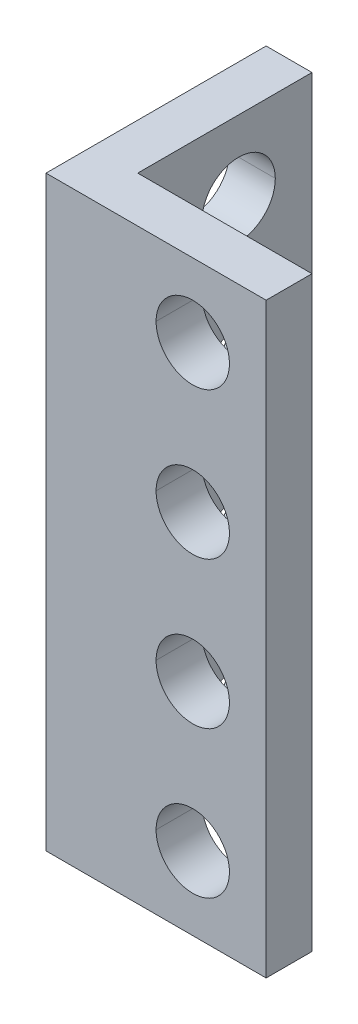
ISO-10303-21;
HEADER;
FILE_DESCRIPTION(('STEP AP214'),'2;1');
FILE_NAME('part.step','',(''),(''),'','','');
FILE_SCHEMA(('AUTOMOTIVE_DESIGN { 1 0 10303 214 1 1 1 1 }'));
ENDSEC;
DATA;
#1=APPLICATION_CONTEXT('core data for automotive mechanical design processes');
#2=APPLICATION_PROTOCOL_DEFINITION('international standard','automotive_design',2000,#1);
#3=PRODUCT_CONTEXT('',#1,'mechanical');
#4=PRODUCT('Part','Part','',(#3));
#5=PRODUCT_RELATED_PRODUCT_CATEGORY('part','',(#4));
#6=PRODUCT_DEFINITION_FORMATION('','',#4);
#7=PRODUCT_DEFINITION_CONTEXT('part definition',#1,'design');
#8=PRODUCT_DEFINITION('design','',#6,#7);
#9=PRODUCT_DEFINITION_SHAPE('','',#8);
#10=(LENGTH_UNIT() NAMED_UNIT(*) SI_UNIT(.MILLI.,.METRE.));
#11=(NAMED_UNIT(*) PLANE_ANGLE_UNIT() SI_UNIT($,.RADIAN.));
#12=(NAMED_UNIT(*) SI_UNIT($,.STERADIAN.) SOLID_ANGLE_UNIT());
#13=UNCERTAINTY_MEASURE_WITH_UNIT(LENGTH_MEASURE(1.E-05),#10,'distance_accuracy_value','');
#14=(GEOMETRIC_REPRESENTATION_CONTEXT(3) GLOBAL_UNCERTAINTY_ASSIGNED_CONTEXT((#13)) GLOBAL_UNIT_ASSIGNED_CONTEXT((#10,
#11,#12)) REPRESENTATION_CONTEXT('',''));
#15=CARTESIAN_POINT('',(0.,0.,0.));
#16=DIRECTION('',(0.,0.,1.));
#17=DIRECTION('',(1.,0.,0.));
#18=AXIS2_PLACEMENT_3D('',#15,#16,#17);
#19=CARTESIAN_POINT('',(12.,28.,-8.));
#20=DIRECTION('',(-1.,0.,0.));
#21=DIRECTION('',(0.,0.,1.));
#22=AXIS2_PLACEMENT_3D('',#19,#20,#21);
#23=CYLINDRICAL_SURFACE('',#22,2.);
#24=DIRECTION('',(-1.,0.,0.));
#25=VECTOR('',#24,1.);
#26=CARTESIAN_POINT('',(12.,28.,-10.));
#27=LINE('',#26,#25);
#28=CARTESIAN_POINT('',(2.5,28.,-10.));
#29=VERTEX_POINT('',#28);
#30=CARTESIAN_POINT('',(0.,28.,-10.));
#31=VERTEX_POINT('',#30);
#32=EDGE_CURVE('E250',#29,#31,#27,.T.);
#33=ORIENTED_EDGE('',*,*,#32,.F.);
#34=CARTESIAN_POINT('',(2.5,28.,-8.));
#35=DIRECTION('',(-1.,0.,0.));
#36=DIRECTION('',(0.,0.,1.));
#37=AXIS2_PLACEMENT_3D('',#34,#35,#36);
#38=CIRCLE('',#37,2.);
#39=CARTESIAN_POINT('',(2.5,28.,-6.));
#40=VERTEX_POINT('',#39);
#41=EDGE_CURVE('E59',#40,#29,#38,.T.);
#42=ORIENTED_EDGE('',*,*,#41,.F.);
#43=DIRECTION('',(-1.,0.,0.));
#44=VECTOR('',#43,1.);
#45=CARTESIAN_POINT('',(12.,28.,-6.));
#46=LINE('',#45,#44);
#47=CARTESIAN_POINT('',(0.,28.,-6.));
#48=VERTEX_POINT('',#47);
#49=EDGE_CURVE('E282',#40,#48,#46,.T.);
#50=ORIENTED_EDGE('',*,*,#49,.T.);
#51=CARTESIAN_POINT('',(0.,28.,-8.));
#52=DIRECTION('',(-1.,0.,0.));
#53=DIRECTION('',(0.,0.,1.));
#54=AXIS2_PLACEMENT_3D('',#51,#52,#53);
#55=CIRCLE('',#54,2.);
#56=EDGE_CURVE('E189',#48,#31,#55,.T.);
#57=ORIENTED_EDGE('',*,*,#56,.T.);
#58=EDGE_LOOP('',(#33,#42,#50,#57));
#59=FACE_BOUND('',#58,.T.);
#60=ADVANCED_FACE('F15',(#59),#23,.F.);
#61=CARTESIAN_POINT('',(12.,20.,-8.));
#62=DIRECTION('',(-1.,0.,0.));
#63=DIRECTION('',(0.,0.,1.));
#64=AXIS2_PLACEMENT_3D('',#61,#62,#63);
#65=CYLINDRICAL_SURFACE('',#64,2.);
#66=DIRECTION('',(-1.,0.,0.));
#67=VECTOR('',#66,1.);
#68=CARTESIAN_POINT('',(12.,20.,-10.));
#69=LINE('',#68,#67);
#70=CARTESIAN_POINT('',(2.5,20.,-10.));
#71=VERTEX_POINT('',#70);
#72=CARTESIAN_POINT('',(0.,20.,-10.));
#73=VERTEX_POINT('',#72);
#74=EDGE_CURVE('E341',#71,#73,#69,.T.);
#75=ORIENTED_EDGE('',*,*,#74,.F.);
#76=CARTESIAN_POINT('',(2.5,20.,-8.));
#77=DIRECTION('',(-1.,0.,0.));
#78=DIRECTION('',(0.,0.,1.));
#79=AXIS2_PLACEMENT_3D('',#76,#77,#78);
#80=CIRCLE('',#79,2.);
#81=CARTESIAN_POINT('',(2.5,20.,-6.));
#82=VERTEX_POINT('',#81);
#83=EDGE_CURVE('E276',#82,#71,#80,.T.);
#84=ORIENTED_EDGE('',*,*,#83,.F.);
#85=DIRECTION('',(-1.,0.,0.));
#86=VECTOR('',#85,1.);
#87=CARTESIAN_POINT('',(12.,20.,-6.));
#88=LINE('',#87,#86);
#89=CARTESIAN_POINT('',(0.,20.,-6.));
#90=VERTEX_POINT('',#89);
#91=EDGE_CURVE('E220',#82,#90,#88,.T.);
#92=ORIENTED_EDGE('',*,*,#91,.T.);
#93=CARTESIAN_POINT('',(0.,20.,-8.));
#94=DIRECTION('',(-1.,0.,0.));
#95=DIRECTION('',(0.,0.,1.));
#96=AXIS2_PLACEMENT_3D('',#93,#94,#95);
#97=CIRCLE('',#96,2.);
#98=EDGE_CURVE('E367',#90,#73,#97,.T.);
#99=ORIENTED_EDGE('',*,*,#98,.T.);
#100=EDGE_LOOP('',(#75,#84,#92,#99));
#101=FACE_BOUND('',#100,.T.);
#102=ADVANCED_FACE('F450',(#101),#65,.F.);
#103=CARTESIAN_POINT('',(12.,12.,-8.));
#104=DIRECTION('',(-1.,0.,0.));
#105=DIRECTION('',(0.,0.,1.));
#106=AXIS2_PLACEMENT_3D('',#103,#104,#105);
#107=CYLINDRICAL_SURFACE('',#106,2.);
#108=DIRECTION('',(-1.,0.,0.));
#109=VECTOR('',#108,1.);
#110=CARTESIAN_POINT('',(12.,12.,-10.));
#111=LINE('',#110,#109);
#112=CARTESIAN_POINT('',(2.5,12.,-10.));
#113=VERTEX_POINT('',#112);
#114=CARTESIAN_POINT('',(0.,12.,-10.));
#115=VERTEX_POINT('',#114);
#116=EDGE_CURVE('E219',#113,#115,#111,.T.);
#117=ORIENTED_EDGE('',*,*,#116,.F.);
#118=CARTESIAN_POINT('',(2.5,12.,-8.));
#119=DIRECTION('',(-1.,0.,0.));
#120=DIRECTION('',(0.,0.,1.));
#121=AXIS2_PLACEMENT_3D('',#118,#119,#120);
#122=CIRCLE('',#121,2.);
#123=CARTESIAN_POINT('',(2.5,12.,-6.));
#124=VERTEX_POINT('',#123);
#125=EDGE_CURVE('E221',#124,#113,#122,.T.);
#126=ORIENTED_EDGE('',*,*,#125,.F.);
#127=DIRECTION('',(-1.,0.,0.));
#128=VECTOR('',#127,1.);
#129=CARTESIAN_POINT('',(12.,12.,-6.));
#130=LINE('',#129,#128);
#131=CARTESIAN_POINT('',(0.,12.,-6.));
#132=VERTEX_POINT('',#131);
#133=EDGE_CURVE('E332',#124,#132,#130,.T.);
#134=ORIENTED_EDGE('',*,*,#133,.T.);
#135=CARTESIAN_POINT('',(0.,12.,-8.));
#136=DIRECTION('',(-1.,0.,0.));
#137=DIRECTION('',(0.,0.,1.));
#138=AXIS2_PLACEMENT_3D('',#135,#136,#137);
#139=CIRCLE('',#138,2.);
#140=EDGE_CURVE('E319',#132,#115,#139,.T.);
#141=ORIENTED_EDGE('',*,*,#140,.T.);
#142=EDGE_LOOP('',(#117,#126,#134,#141));
#143=FACE_BOUND('',#142,.T.);
#144=ADVANCED_FACE('F626',(#143),#107,.F.);
#145=CARTESIAN_POINT('',(8.,28.,-12.));
#146=DIRECTION('',(0.,0.,1.));
#147=DIRECTION('',(1.,0.,0.));
#148=AXIS2_PLACEMENT_3D('',#145,#146,#147);
#149=CYLINDRICAL_SURFACE('',#148,2.);
#150=DIRECTION('',(0.,0.,1.));
#151=VECTOR('',#150,1.);
#152=CARTESIAN_POINT('',(6.,28.,-12.));
#153=LINE('',#152,#151);
#154=CARTESIAN_POINT('',(6.,28.,-2.5));
#155=VERTEX_POINT('',#154);
#156=CARTESIAN_POINT('',(6.,28.,0.));
#157=VERTEX_POINT('',#156);
#158=EDGE_CURVE('E407',#155,#157,#153,.T.);
#159=ORIENTED_EDGE('',*,*,#158,.F.);
#160=CARTESIAN_POINT('',(8.,28.,-2.5));
#161=DIRECTION('',(0.,0.,1.));
#162=DIRECTION('',(-1.,0.,0.));
#163=AXIS2_PLACEMENT_3D('',#160,#161,#162);
#164=CIRCLE('',#163,2.);
#165=CARTESIAN_POINT('',(10.,28.,-2.50000000000004));
#166=VERTEX_POINT('',#165);
#167=EDGE_CURVE('E204',#166,#155,#164,.T.);
#168=ORIENTED_EDGE('',*,*,#167,.F.);
#169=DIRECTION('',(0.,0.,1.));
#170=VECTOR('',#169,1.);
#171=CARTESIAN_POINT('',(10.,28.,-12.));
#172=LINE('',#171,#170);
#173=CARTESIAN_POINT('',(10.,28.,0.));
#174=VERTEX_POINT('',#173);
#175=EDGE_CURVE('E357',#166,#174,#172,.T.);
#176=ORIENTED_EDGE('',*,*,#175,.T.);
#177=CARTESIAN_POINT('',(8.,28.,0.));
#178=DIRECTION('',(0.,0.,-1.));
#179=DIRECTION('',(-1.,0.,0.));
#180=AXIS2_PLACEMENT_3D('',#177,#178,#179);
#181=CIRCLE('',#180,2.);
#182=EDGE_CURVE('E229',#157,#174,#181,.T.);
#183=ORIENTED_EDGE('',*,*,#182,.F.);
#184=EDGE_LOOP('',(#159,#168,#176,#183));
#185=FACE_BOUND('',#184,.T.);
#186=ADVANCED_FACE('F541',(#185),#149,.F.);
#187=CARTESIAN_POINT('',(8.,20.,-12.));
#188=DIRECTION('',(0.,0.,1.));
#189=DIRECTION('',(1.,0.,0.));
#190=AXIS2_PLACEMENT_3D('',#187,#188,#189);
#191=CYLINDRICAL_SURFACE('',#190,2.);
#192=DIRECTION('',(0.,0.,1.));
#193=VECTOR('',#192,1.);
#194=CARTESIAN_POINT('',(6.,20.,-12.));
#195=LINE('',#194,#193);
#196=CARTESIAN_POINT('',(6.,20.,-2.5));
#197=VERTEX_POINT('',#196);
#198=CARTESIAN_POINT('',(6.,20.,0.));
#199=VERTEX_POINT('',#198);
#200=EDGE_CURVE('E323',#197,#199,#195,.T.);
#201=ORIENTED_EDGE('',*,*,#200,.F.);
#202=CARTESIAN_POINT('',(8.,20.,-2.5));
#203=DIRECTION('',(0.,0.,1.));
#204=DIRECTION('',(-1.,0.,0.));
#205=AXIS2_PLACEMENT_3D('',#202,#203,#204);
#206=CIRCLE('',#205,2.);
#207=CARTESIAN_POINT('',(10.,20.,-2.50000000000004));
#208=VERTEX_POINT('',#207);
#209=EDGE_CURVE('E378',#208,#197,#206,.T.);
#210=ORIENTED_EDGE('',*,*,#209,.F.);
#211=DIRECTION('',(0.,0.,1.));
#212=VECTOR('',#211,1.);
#213=CARTESIAN_POINT('',(10.,20.,-12.));
#214=LINE('',#213,#212);
#215=CARTESIAN_POINT('',(10.,20.,0.));
#216=VERTEX_POINT('',#215);
#217=EDGE_CURVE('E241',#208,#216,#214,.T.);
#218=ORIENTED_EDGE('',*,*,#217,.T.);
#219=CARTESIAN_POINT('',(8.,20.,0.));
#220=DIRECTION('',(0.,0.,-1.));
#221=DIRECTION('',(-1.,0.,0.));
#222=AXIS2_PLACEMENT_3D('',#219,#220,#221);
#223=CIRCLE('',#222,2.);
#224=EDGE_CURVE('E226',#199,#216,#223,.T.);
#225=ORIENTED_EDGE('',*,*,#224,.F.);
#226=EDGE_LOOP('',(#201,#210,#218,#225));
#227=FACE_BOUND('',#226,.T.);
#228=ADVANCED_FACE('F509',(#227),#191,.F.);
#229=CARTESIAN_POINT('',(8.,12.,-12.));
#230=DIRECTION('',(0.,0.,1.));
#231=DIRECTION('',(1.,0.,0.));
#232=AXIS2_PLACEMENT_3D('',#229,#230,#231);
#233=CYLINDRICAL_SURFACE('',#232,2.);
#234=DIRECTION('',(0.,0.,1.));
#235=VECTOR('',#234,1.);
#236=CARTESIAN_POINT('',(6.,12.,-12.));
#237=LINE('',#236,#235);
#238=CARTESIAN_POINT('',(6.,12.,-2.5));
#239=VERTEX_POINT('',#238);
#240=CARTESIAN_POINT('',(6.,12.,0.));
#241=VERTEX_POINT('',#240);
#242=EDGE_CURVE('E251',#239,#241,#237,.T.);
#243=ORIENTED_EDGE('',*,*,#242,.F.);
#244=CARTESIAN_POINT('',(8.,12.,-2.5));
#245=DIRECTION('',(0.,0.,1.));
#246=DIRECTION('',(-1.,0.,0.));
#247=AXIS2_PLACEMENT_3D('',#244,#245,#246);
#248=CIRCLE('',#247,2.);
#249=CARTESIAN_POINT('',(10.,12.,-2.50000000000004));
#250=VERTEX_POINT('',#249);
#251=EDGE_CURVE('E211',#250,#239,#248,.T.);
#252=ORIENTED_EDGE('',*,*,#251,.F.);
#253=DIRECTION('',(0.,0.,1.));
#254=VECTOR('',#253,1.);
#255=CARTESIAN_POINT('',(10.,12.,-12.));
#256=LINE('',#255,#254);
#257=CARTESIAN_POINT('',(10.,12.,0.));
#258=VERTEX_POINT('',#257);
#259=EDGE_CURVE('E265',#250,#258,#256,.T.);
#260=ORIENTED_EDGE('',*,*,#259,.T.);
#261=CARTESIAN_POINT('',(8.,12.,0.));
#262=DIRECTION('',(0.,0.,-1.));
#263=DIRECTION('',(-1.,0.,0.));
#264=AXIS2_PLACEMENT_3D('',#261,#262,#263);
#265=CIRCLE('',#264,2.);
#266=EDGE_CURVE('E230',#241,#258,#265,.T.);
#267=ORIENTED_EDGE('',*,*,#266,.F.);
#268=EDGE_LOOP('',(#243,#252,#260,#267));
#269=FACE_BOUND('',#268,.T.);
#270=ADVANCED_FACE('F556',(#269),#233,.F.);
#271=CARTESIAN_POINT('',(0.,32.,0.));
#272=DIRECTION('',(0.,1.,0.));
#273=DIRECTION('',(1.,0.,0.));
#274=AXIS2_PLACEMENT_3D('',#271,#272,#273);
#275=PLANE('',#274);
#276=DIRECTION('',(1.,0.,0.));
#277=VECTOR('',#276,1.);
#278=CARTESIAN_POINT('',(0.,32.,-2.5));
#279=LINE('',#278,#277);
#280=CARTESIAN_POINT('',(2.5,32.,-2.5));
#281=VERTEX_POINT('',#280);
#282=CARTESIAN_POINT('',(12.,32.,-2.50000000000005));
#283=VERTEX_POINT('',#282);
#284=EDGE_CURVE('E353',#281,#283,#279,.T.);
#285=ORIENTED_EDGE('',*,*,#284,.F.);
#286=DIRECTION('',(0.,0.,-1.));
#287=VECTOR('',#286,1.);
#288=CARTESIAN_POINT('',(2.5,32.,0.));
#289=LINE('',#288,#287);
#290=CARTESIAN_POINT('',(2.5,32.,-12.));
#291=VERTEX_POINT('',#290);
#292=EDGE_CURVE('E225',#281,#291,#289,.T.);
#293=ORIENTED_EDGE('',*,*,#292,.T.);
#294=DIRECTION('',(1.,0.,0.));
#295=VECTOR('',#294,1.);
#296=CARTESIAN_POINT('',(0.,32.,-12.));
#297=LINE('',#296,#295);
#298=CARTESIAN_POINT('',(0.,32.,-12.));
#299=VERTEX_POINT('',#298);
#300=EDGE_CURVE('E313',#299,#291,#297,.T.);
#301=ORIENTED_EDGE('',*,*,#300,.F.);
#302=DIRECTION('',(0.,0.,-1.));
#303=VECTOR('',#302,1.);
#304=CARTESIAN_POINT('',(0.,32.,0.));
#305=LINE('',#304,#303);
#306=CARTESIAN_POINT('',(0.,32.,0.));
#307=VERTEX_POINT('',#306);
#308=EDGE_CURVE('E40',#307,#299,#305,.T.);
#309=ORIENTED_EDGE('',*,*,#308,.F.);
#310=DIRECTION('',(1.,0.,0.));
#311=VECTOR('',#310,1.);
#312=CARTESIAN_POINT('',(0.,32.,0.));
#313=LINE('',#312,#311);
#314=CARTESIAN_POINT('',(12.,32.,0.));
#315=VERTEX_POINT('',#314);
#316=EDGE_CURVE('E198',#307,#315,#313,.T.);
#317=ORIENTED_EDGE('',*,*,#316,.T.);
#318=DIRECTION('',(0.,0.,-1.));
#319=VECTOR('',#318,1.);
#320=CARTESIAN_POINT('',(12.,32.,0.));
#321=LINE('',#320,#319);
#322=EDGE_CURVE('E10',#315,#283,#321,.T.);
#323=ORIENTED_EDGE('',*,*,#322,.T.);
#324=EDGE_LOOP('',(#285,#293,#301,#309,#317,#323));
#325=FACE_BOUND('',#324,.T.);
#326=ADVANCED_FACE('F417',(#325),#275,.T.);
#327=CARTESIAN_POINT('',(8.,4.,-12.));
#328=DIRECTION('',(0.,0.,1.));
#329=DIRECTION('',(1.,0.,0.));
#330=AXIS2_PLACEMENT_3D('',#327,#328,#329);
#331=CYLINDRICAL_SURFACE('',#330,2.);
#332=DIRECTION('',(0.,0.,1.));
#333=VECTOR('',#332,1.);
#334=CARTESIAN_POINT('',(6.,4.,-12.));
#335=LINE('',#334,#333);
#336=CARTESIAN_POINT('',(6.,4.,-2.5));
#337=VERTEX_POINT('',#336);
#338=CARTESIAN_POINT('',(6.,4.,0.));
#339=VERTEX_POINT('',#338);
#340=EDGE_CURVE('E264',#337,#339,#335,.T.);
#341=ORIENTED_EDGE('',*,*,#340,.F.);
#342=CARTESIAN_POINT('',(8.,4.,-2.5));
#343=DIRECTION('',(0.,0.,1.));
#344=DIRECTION('',(-1.,0.,0.));
#345=AXIS2_PLACEMENT_3D('',#342,#343,#344);
#346=CIRCLE('',#345,2.);
#347=CARTESIAN_POINT('',(10.,4.,-2.50000000000004));
#348=VERTEX_POINT('',#347);
#349=EDGE_CURVE('E403',#348,#337,#346,.T.);
#350=ORIENTED_EDGE('',*,*,#349,.F.);
#351=DIRECTION('',(0.,0.,1.));
#352=VECTOR('',#351,1.);
#353=CARTESIAN_POINT('',(10.,4.,-12.));
#354=LINE('',#353,#352);
#355=CARTESIAN_POINT('',(10.,4.,0.));
#356=VERTEX_POINT('',#355);
#357=EDGE_CURVE('E236',#348,#356,#354,.T.);
#358=ORIENTED_EDGE('',*,*,#357,.T.);
#359=CARTESIAN_POINT('',(8.,4.,0.));
#360=DIRECTION('',(0.,0.,-1.));
#361=DIRECTION('',(-1.,0.,0.));
#362=AXIS2_PLACEMENT_3D('',#359,#360,#361);
#363=CIRCLE('',#362,2.);
#364=EDGE_CURVE('E237',#339,#356,#363,.T.);
#365=ORIENTED_EDGE('',*,*,#364,.F.);
#366=EDGE_LOOP('',(#341,#350,#358,#365));
#367=FACE_BOUND('',#366,.T.);
#368=ADVANCED_FACE('F488',(#367),#331,.F.);
#369=CARTESIAN_POINT('',(12.,4.,-8.));
#370=DIRECTION('',(-1.,0.,0.));
#371=DIRECTION('',(0.,0.,1.));
#372=AXIS2_PLACEMENT_3D('',#369,#370,#371);
#373=CYLINDRICAL_SURFACE('',#372,2.);
#374=DIRECTION('',(-1.,0.,0.));
#375=VECTOR('',#374,1.);
#376=CARTESIAN_POINT('',(12.,4.,-10.));
#377=LINE('',#376,#375);
#378=CARTESIAN_POINT('',(2.5,4.,-10.));
#379=VERTEX_POINT('',#378);
#380=CARTESIAN_POINT('',(0.,4.,-10.));
#381=VERTEX_POINT('',#380);
#382=EDGE_CURVE('E235',#379,#381,#377,.T.);
#383=ORIENTED_EDGE('',*,*,#382,.F.);
#384=CARTESIAN_POINT('',(2.5,4.,-8.));
#385=DIRECTION('',(-1.,0.,0.));
#386=DIRECTION('',(0.,0.,1.));
#387=AXIS2_PLACEMENT_3D('',#384,#385,#386);
#388=CIRCLE('',#387,2.);
#389=CARTESIAN_POINT('',(2.5,4.,-6.));
#390=VERTEX_POINT('',#389);
#391=EDGE_CURVE('E224',#390,#379,#388,.T.);
#392=ORIENTED_EDGE('',*,*,#391,.F.);
#393=DIRECTION('',(-1.,0.,0.));
#394=VECTOR('',#393,1.);
#395=CARTESIAN_POINT('',(12.,4.,-6.));
#396=LINE('',#395,#394);
#397=CARTESIAN_POINT('',(0.,4.,-6.));
#398=VERTEX_POINT('',#397);
#399=EDGE_CURVE('E259',#390,#398,#396,.T.);
#400=ORIENTED_EDGE('',*,*,#399,.T.);
#401=CARTESIAN_POINT('',(0.,4.,-8.));
#402=DIRECTION('',(-1.,0.,0.));
#403=DIRECTION('',(0.,0.,1.));
#404=AXIS2_PLACEMENT_3D('',#401,#402,#403);
#405=CIRCLE('',#404,2.);
#406=EDGE_CURVE('E372',#398,#381,#405,.T.);
#407=ORIENTED_EDGE('',*,*,#406,.T.);
#408=EDGE_LOOP('',(#383,#392,#400,#407));
#409=FACE_BOUND('',#408,.T.);
#410=ADVANCED_FACE('F650',(#409),#373,.F.);
#411=CARTESIAN_POINT('',(0.,0.,0.));
#412=DIRECTION('',(0.,1.,0.));
#413=DIRECTION('',(1.,0.,0.));
#414=AXIS2_PLACEMENT_3D('',#411,#412,#413);
#415=PLANE('',#414);
#416=DIRECTION('',(1.,0.,0.));
#417=VECTOR('',#416,1.);
#418=CARTESIAN_POINT('',(0.,0.,-2.5));
#419=LINE('',#418,#417);
#420=CARTESIAN_POINT('',(2.5,0.,-2.5));
#421=VERTEX_POINT('',#420);
#422=CARTESIAN_POINT('',(12.,0.,-2.50000000000005));
#423=VERTEX_POINT('',#422);
#424=EDGE_CURVE('E184',#421,#423,#419,.T.);
#425=ORIENTED_EDGE('',*,*,#424,.T.);
#426=DIRECTION('',(0.,0.,-1.));
#427=VECTOR('',#426,1.);
#428=CARTESIAN_POINT('',(12.,0.,0.));
#429=LINE('',#428,#427);
#430=CARTESIAN_POINT('',(12.,0.,0.));
#431=VERTEX_POINT('',#430);
#432=EDGE_CURVE('E25',#431,#423,#429,.T.);
#433=ORIENTED_EDGE('',*,*,#432,.F.);
#434=DIRECTION('',(1.,0.,0.));
#435=VECTOR('',#434,1.);
#436=CARTESIAN_POINT('',(0.,0.,0.));
#437=LINE('',#436,#435);
#438=CARTESIAN_POINT('',(0.,0.,0.));
#439=VERTEX_POINT('',#438);
#440=EDGE_CURVE('E181',#439,#431,#437,.T.);
#441=ORIENTED_EDGE('',*,*,#440,.F.);
#442=DIRECTION('',(0.,0.,-1.));
#443=VECTOR('',#442,1.);
#444=CARTESIAN_POINT('',(0.,0.,0.));
#445=LINE('',#444,#443);
#446=CARTESIAN_POINT('',(0.,0.,-12.));
#447=VERTEX_POINT('',#446);
#448=EDGE_CURVE('E311',#439,#447,#445,.T.);
#449=ORIENTED_EDGE('',*,*,#448,.T.);
#450=DIRECTION('',(1.,0.,0.));
#451=VECTOR('',#450,1.);
#452=CARTESIAN_POINT('',(0.,0.,-12.));
#453=LINE('',#452,#451);
#454=CARTESIAN_POINT('',(2.5,0.,-12.));
#455=VERTEX_POINT('',#454);
#456=EDGE_CURVE('E281',#447,#455,#453,.T.);
#457=ORIENTED_EDGE('',*,*,#456,.T.);
#458=DIRECTION('',(0.,0.,-1.));
#459=VECTOR('',#458,1.);
#460=CARTESIAN_POINT('',(2.5,0.,0.));
#461=LINE('',#460,#459);
#462=EDGE_CURVE('E333',#421,#455,#461,.T.);
#463=ORIENTED_EDGE('',*,*,#462,.F.);
#464=EDGE_LOOP('',(#425,#433,#441,#449,#457,#463));
#465=FACE_BOUND('',#464,.T.);
#466=ADVANCED_FACE('F179',(#465),#415,.F.);
#467=CARTESIAN_POINT('',(12.,8.,0.));
#468=DIRECTION('',(-1.,0.,0.));
#469=DIRECTION('',(0.,1.,0.));
#470=AXIS2_PLACEMENT_3D('',#467,#468,#469);
#471=PLANE('',#470);
#472=ORIENTED_EDGE('',*,*,#432,.T.);
#473=DIRECTION('',(0.,-1.,0.));
#474=VECTOR('',#473,1.);
#475=CARTESIAN_POINT('',(12.,8.,-2.50000000000005));
#476=LINE('',#475,#474);
#477=EDGE_CURVE('E375',#283,#423,#476,.T.);
#478=ORIENTED_EDGE('',*,*,#477,.F.);
#479=ORIENTED_EDGE('',*,*,#322,.F.);
#480=DIRECTION('',(0.,-1.,0.));
#481=VECTOR('',#480,1.);
#482=CARTESIAN_POINT('',(12.,8.,0.));
#483=LINE('',#482,#481);
#484=EDGE_CURVE('E192',#315,#431,#483,.T.);
#485=ORIENTED_EDGE('',*,*,#484,.T.);
#486=EDGE_LOOP('',(#472,#478,#479,#485));
#487=FACE_BOUND('',#486,.T.);
#488=ADVANCED_FACE('F193',(#487),#471,.F.);
#489=CARTESIAN_POINT('',(0.,8.,0.));
#490=DIRECTION('',(-1.,0.,0.));
#491=DIRECTION('',(0.,0.,1.));
#492=AXIS2_PLACEMENT_3D('',#489,#490,#491);
#493=PLANE('',#492);
#494=ORIENTED_EDGE('',*,*,#56,.F.);
#495=CARTESIAN_POINT('',(0.,28.,-8.));
#496=DIRECTION('',(-1.,0.,0.));
#497=DIRECTION('',(0.,0.,1.));
#498=AXIS2_PLACEMENT_3D('',#495,#496,#497);
#499=CIRCLE('',#498,2.);
#500=EDGE_CURVE('E269',#31,#48,#499,.T.);
#501=ORIENTED_EDGE('',*,*,#500,.F.);
#502=EDGE_LOOP('',(#494,#501));
#503=FACE_BOUND('',#502,.T.);
#504=ORIENTED_EDGE('',*,*,#98,.F.);
#505=CARTESIAN_POINT('',(0.,20.,-8.));
#506=DIRECTION('',(-1.,0.,0.));
#507=DIRECTION('',(0.,0.,1.));
#508=AXIS2_PLACEMENT_3D('',#505,#506,#507);
#509=CIRCLE('',#508,2.);
#510=EDGE_CURVE('E337',#73,#90,#509,.T.);
#511=ORIENTED_EDGE('',*,*,#510,.F.);
#512=EDGE_LOOP('',(#504,#511));
#513=FACE_BOUND('',#512,.T.);
#514=ORIENTED_EDGE('',*,*,#406,.F.);
#515=CARTESIAN_POINT('',(0.,4.,-8.));
#516=DIRECTION('',(-1.,0.,0.));
#517=DIRECTION('',(0.,0.,1.));
#518=AXIS2_PLACEMENT_3D('',#515,#516,#517);
#519=CIRCLE('',#518,2.);
#520=EDGE_CURVE('E287',#381,#398,#519,.T.);
#521=ORIENTED_EDGE('',*,*,#520,.F.);
#522=EDGE_LOOP('',(#514,#521));
#523=FACE_BOUND('',#522,.T.);
#524=ORIENTED_EDGE('',*,*,#140,.F.);
#525=CARTESIAN_POINT('',(0.,12.,-8.));
#526=DIRECTION('',(-1.,0.,0.));
#527=DIRECTION('',(0.,0.,1.));
#528=AXIS2_PLACEMENT_3D('',#525,#526,#527);
#529=CIRCLE('',#528,2.);
#530=EDGE_CURVE('E328',#115,#132,#529,.T.);
#531=ORIENTED_EDGE('',*,*,#530,.F.);
#532=EDGE_LOOP('',(#524,#531));
#533=FACE_BOUND('',#532,.T.);
#534=ORIENTED_EDGE('',*,*,#448,.F.);
#535=DIRECTION('',(0.,-1.,0.));
#536=VECTOR('',#535,1.);
#537=CARTESIAN_POINT('',(0.,8.,0.));
#538=LINE('',#537,#536);
#539=EDGE_CURVE('E202',#307,#439,#538,.T.);
#540=ORIENTED_EDGE('',*,*,#539,.F.);
#541=ORIENTED_EDGE('',*,*,#308,.T.);
#542=DIRECTION('',(0.,-1.,0.));
#543=VECTOR('',#542,1.);
#544=CARTESIAN_POINT('',(0.,8.,-12.));
#545=LINE('',#544,#543);
#546=EDGE_CURVE('E391',#299,#447,#545,.T.);
#547=ORIENTED_EDGE('',*,*,#546,.T.);
#548=EDGE_LOOP('',(#534,#540,#541,#547));
#549=FACE_BOUND('',#548,.T.);
#550=ADVANCED_FACE('F454',(#503,#513,#523,#533,#549),#493,.T.);
#551=CARTESIAN_POINT('',(0.,8.,-12.));
#552=DIRECTION('',(0.,0.,-1.));
#553=DIRECTION('',(0.,-1.,0.));
#554=AXIS2_PLACEMENT_3D('',#551,#552,#553);
#555=PLANE('',#554);
#556=ORIENTED_EDGE('',*,*,#456,.F.);
#557=ORIENTED_EDGE('',*,*,#546,.F.);
#558=ORIENTED_EDGE('',*,*,#300,.T.);
#559=DIRECTION('',(0.,-1.,0.));
#560=VECTOR('',#559,1.);
#561=CARTESIAN_POINT('',(2.5,8.,-12.));
#562=LINE('',#561,#560);
#563=EDGE_CURVE('E18',#291,#455,#562,.T.);
#564=ORIENTED_EDGE('',*,*,#563,.T.);
#565=EDGE_LOOP('',(#556,#557,#558,#564));
#566=FACE_BOUND('',#565,.T.);
#567=ADVANCED_FACE('F462',(#566),#555,.T.);
#568=CARTESIAN_POINT('',(2.5,8.,0.));
#569=DIRECTION('',(-1.,0.,0.));
#570=DIRECTION('',(0.,0.,1.));
#571=AXIS2_PLACEMENT_3D('',#568,#569,#570);
#572=PLANE('',#571);
#573=ORIENTED_EDGE('',*,*,#41,.T.);
#574=CARTESIAN_POINT('',(2.5,28.,-8.));
#575=DIRECTION('',(-1.,0.,0.));
#576=DIRECTION('',(0.,0.,1.));
#577=AXIS2_PLACEMENT_3D('',#574,#575,#576);
#578=CIRCLE('',#577,2.);
#579=EDGE_CURVE('E247',#29,#40,#578,.T.);
#580=ORIENTED_EDGE('',*,*,#579,.T.);
#581=EDGE_LOOP('',(#573,#580));
#582=FACE_BOUND('',#581,.T.);
#583=ORIENTED_EDGE('',*,*,#83,.T.);
#584=CARTESIAN_POINT('',(2.5,20.,-8.));
#585=DIRECTION('',(-1.,0.,0.));
#586=DIRECTION('',(0.,0.,1.));
#587=AXIS2_PLACEMENT_3D('',#584,#585,#586);
#588=CIRCLE('',#587,2.);
#589=EDGE_CURVE('E284',#71,#82,#588,.T.);
#590=ORIENTED_EDGE('',*,*,#589,.T.);
#591=EDGE_LOOP('',(#583,#590));
#592=FACE_BOUND('',#591,.T.);
#593=ORIENTED_EDGE('',*,*,#391,.T.);
#594=CARTESIAN_POINT('',(2.5,4.,-8.));
#595=DIRECTION('',(-1.,0.,0.));
#596=DIRECTION('',(0.,0.,1.));
#597=AXIS2_PLACEMENT_3D('',#594,#595,#596);
#598=CIRCLE('',#597,2.);
#599=EDGE_CURVE('E231',#379,#390,#598,.T.);
#600=ORIENTED_EDGE('',*,*,#599,.T.);
#601=EDGE_LOOP('',(#593,#600));
#602=FACE_BOUND('',#601,.T.);
#603=ORIENTED_EDGE('',*,*,#125,.T.);
#604=CARTESIAN_POINT('',(2.5,12.,-8.));
#605=DIRECTION('',(-1.,0.,0.));
#606=DIRECTION('',(0.,0.,1.));
#607=AXIS2_PLACEMENT_3D('',#604,#605,#606);
#608=CIRCLE('',#607,2.);
#609=EDGE_CURVE('E216',#113,#124,#608,.T.);
#610=ORIENTED_EDGE('',*,*,#609,.T.);
#611=EDGE_LOOP('',(#603,#610));
#612=FACE_BOUND('',#611,.T.);
#613=ORIENTED_EDGE('',*,*,#462,.T.);
#614=ORIENTED_EDGE('',*,*,#563,.F.);
#615=ORIENTED_EDGE('',*,*,#292,.F.);
#616=DIRECTION('',(0.,-1.,0.));
#617=VECTOR('',#616,1.);
#618=CARTESIAN_POINT('',(2.5,8.,-2.5));
#619=LINE('',#618,#617);
#620=EDGE_CURVE('E258',#281,#421,#619,.T.);
#621=ORIENTED_EDGE('',*,*,#620,.T.);
#622=EDGE_LOOP('',(#613,#614,#615,#621));
#623=FACE_BOUND('',#622,.T.);
#624=ADVANCED_FACE('F459',(#582,#592,#602,#612,#623),#572,.F.);
#625=CARTESIAN_POINT('',(0.,8.,0.));
#626=DIRECTION('',(0.,0.,-1.));
#627=DIRECTION('',(-1.,0.,0.));
#628=AXIS2_PLACEMENT_3D('',#625,#626,#627);
#629=PLANE('',#628);
#630=CARTESIAN_POINT('',(8.,28.,0.));
#631=DIRECTION('',(0.,0.,-1.));
#632=DIRECTION('',(-1.,0.,0.));
#633=AXIS2_PLACEMENT_3D('',#630,#631,#632);
#634=CIRCLE('',#633,2.);
#635=EDGE_CURVE('E361',#174,#157,#634,.T.);
#636=ORIENTED_EDGE('',*,*,#635,.T.);
#637=ORIENTED_EDGE('',*,*,#182,.T.);
#638=EDGE_LOOP('',(#636,#637));
#639=FACE_BOUND('',#638,.T.);
#640=CARTESIAN_POINT('',(8.,20.,0.));
#641=DIRECTION('',(0.,0.,-1.));
#642=DIRECTION('',(-1.,0.,0.));
#643=AXIS2_PLACEMENT_3D('',#640,#641,#642);
#644=CIRCLE('',#643,2.);
#645=EDGE_CURVE('E246',#216,#199,#644,.T.);
#646=ORIENTED_EDGE('',*,*,#645,.T.);
#647=ORIENTED_EDGE('',*,*,#224,.T.);
#648=EDGE_LOOP('',(#646,#647));
#649=FACE_BOUND('',#648,.T.);
#650=CARTESIAN_POINT('',(8.,12.,0.));
#651=DIRECTION('',(0.,0.,-1.));
#652=DIRECTION('',(-1.,0.,0.));
#653=AXIS2_PLACEMENT_3D('',#650,#651,#652);
#654=CIRCLE('',#653,2.);
#655=EDGE_CURVE('E255',#258,#241,#654,.T.);
#656=ORIENTED_EDGE('',*,*,#655,.T.);
#657=ORIENTED_EDGE('',*,*,#266,.T.);
#658=EDGE_LOOP('',(#656,#657));
#659=FACE_BOUND('',#658,.T.);
#660=CARTESIAN_POINT('',(8.,4.,0.));
#661=DIRECTION('',(0.,0.,-1.));
#662=DIRECTION('',(-1.,0.,0.));
#663=AXIS2_PLACEMENT_3D('',#660,#661,#662);
#664=CIRCLE('',#663,2.);
#665=EDGE_CURVE('E327',#356,#339,#664,.T.);
#666=ORIENTED_EDGE('',*,*,#665,.T.);
#667=ORIENTED_EDGE('',*,*,#364,.T.);
#668=EDGE_LOOP('',(#666,#667));
#669=FACE_BOUND('',#668,.T.);
#670=ORIENTED_EDGE('',*,*,#440,.T.);
#671=ORIENTED_EDGE('',*,*,#484,.F.);
#672=ORIENTED_EDGE('',*,*,#316,.F.);
#673=ORIENTED_EDGE('',*,*,#539,.T.);
#674=EDGE_LOOP('',(#670,#671,#672,#673));
#675=FACE_BOUND('',#674,.T.);
#676=ADVANCED_FACE('F201',(#639,#649,#659,#669,#675),#629,.F.);
#677=CARTESIAN_POINT('',(0.,8.,-2.5));
#678=DIRECTION('',(0.,0.,-1.));
#679=DIRECTION('',(-1.,0.,0.));
#680=AXIS2_PLACEMENT_3D('',#677,#678,#679);
#681=PLANE('',#680);
#682=ORIENTED_EDGE('',*,*,#167,.T.);
#683=CARTESIAN_POINT('',(8.,28.,-2.5));
#684=DIRECTION('',(0.,0.,1.));
#685=DIRECTION('',(-1.,0.,0.));
#686=AXIS2_PLACEMENT_3D('',#683,#684,#685);
#687=CIRCLE('',#686,2.);
#688=EDGE_CURVE('E387',#155,#166,#687,.T.);
#689=ORIENTED_EDGE('',*,*,#688,.T.);
#690=EDGE_LOOP('',(#682,#689));
#691=FACE_BOUND('',#690,.T.);
#692=ORIENTED_EDGE('',*,*,#251,.T.);
#693=CARTESIAN_POINT('',(8.,12.,-2.5));
#694=DIRECTION('',(0.,0.,1.));
#695=DIRECTION('',(-1.,0.,0.));
#696=AXIS2_PLACEMENT_3D('',#693,#694,#695);
#697=CIRCLE('',#696,2.);
#698=EDGE_CURVE('E245',#239,#250,#697,.T.);
#699=ORIENTED_EDGE('',*,*,#698,.T.);
#700=EDGE_LOOP('',(#692,#699));
#701=FACE_BOUND('',#700,.T.);
#702=ORIENTED_EDGE('',*,*,#349,.T.);
#703=CARTESIAN_POINT('',(8.,4.,-2.5));
#704=DIRECTION('',(0.,0.,1.));
#705=DIRECTION('',(-1.,0.,0.));
#706=AXIS2_PLACEMENT_3D('',#703,#704,#705);
#707=CIRCLE('',#706,2.);
#708=EDGE_CURVE('E260',#337,#348,#707,.T.);
#709=ORIENTED_EDGE('',*,*,#708,.T.);
#710=EDGE_LOOP('',(#702,#709));
#711=FACE_BOUND('',#710,.T.);
#712=ORIENTED_EDGE('',*,*,#209,.T.);
#713=CARTESIAN_POINT('',(8.,20.,-2.5));
#714=DIRECTION('',(0.,0.,1.));
#715=DIRECTION('',(-1.,0.,0.));
#716=AXIS2_PLACEMENT_3D('',#713,#714,#715);
#717=CIRCLE('',#716,2.);
#718=EDGE_CURVE('E360',#197,#208,#717,.T.);
#719=ORIENTED_EDGE('',*,*,#718,.T.);
#720=EDGE_LOOP('',(#712,#719));
#721=FACE_BOUND('',#720,.T.);
#722=ORIENTED_EDGE('',*,*,#424,.F.);
#723=ORIENTED_EDGE('',*,*,#620,.F.);
#724=ORIENTED_EDGE('',*,*,#284,.T.);
#725=ORIENTED_EDGE('',*,*,#477,.T.);
#726=EDGE_LOOP('',(#722,#723,#724,#725));
#727=FACE_BOUND('',#726,.T.);
#728=ADVANCED_FACE('F415',(#691,#701,#711,#721,#727),#681,.T.);
#729=CARTESIAN_POINT('',(12.,4.,-8.));
#730=DIRECTION('',(-1.,0.,0.));
#731=DIRECTION('',(0.,0.,1.));
#732=AXIS2_PLACEMENT_3D('',#729,#730,#731);
#733=CYLINDRICAL_SURFACE('',#732,2.);
#734=ORIENTED_EDGE('',*,*,#599,.F.);
#735=ORIENTED_EDGE('',*,*,#382,.T.);
#736=ORIENTED_EDGE('',*,*,#520,.T.);
#737=ORIENTED_EDGE('',*,*,#399,.F.);
#738=EDGE_LOOP('',(#734,#735,#736,#737));
#739=FACE_BOUND('',#738,.T.);
#740=ADVANCED_FACE('F500',(#739),#733,.F.);
#741=CARTESIAN_POINT('',(8.,4.,-12.));
#742=DIRECTION('',(0.,0.,1.));
#743=DIRECTION('',(1.,0.,0.));
#744=AXIS2_PLACEMENT_3D('',#741,#742,#743);
#745=CYLINDRICAL_SURFACE('',#744,2.);
#746=ORIENTED_EDGE('',*,*,#708,.F.);
#747=ORIENTED_EDGE('',*,*,#340,.T.);
#748=ORIENTED_EDGE('',*,*,#665,.F.);
#749=ORIENTED_EDGE('',*,*,#357,.F.);
#750=EDGE_LOOP('',(#746,#747,#748,#749));
#751=FACE_BOUND('',#750,.T.);
#752=ADVANCED_FACE('F495',(#751),#745,.F.);
#753=CARTESIAN_POINT('',(8.,12.,-12.));
#754=DIRECTION('',(0.,0.,1.));
#755=DIRECTION('',(1.,0.,0.));
#756=AXIS2_PLACEMENT_3D('',#753,#754,#755);
#757=CYLINDRICAL_SURFACE('',#756,2.);
#758=ORIENTED_EDGE('',*,*,#698,.F.);
#759=ORIENTED_EDGE('',*,*,#242,.T.);
#760=ORIENTED_EDGE('',*,*,#655,.F.);
#761=ORIENTED_EDGE('',*,*,#259,.F.);
#762=EDGE_LOOP('',(#758,#759,#760,#761));
#763=FACE_BOUND('',#762,.T.);
#764=ADVANCED_FACE('F554',(#763),#757,.F.);
#765=CARTESIAN_POINT('',(8.,20.,-12.));
#766=DIRECTION('',(0.,0.,1.));
#767=DIRECTION('',(1.,0.,0.));
#768=AXIS2_PLACEMENT_3D('',#765,#766,#767);
#769=CYLINDRICAL_SURFACE('',#768,2.);
#770=ORIENTED_EDGE('',*,*,#718,.F.);
#771=ORIENTED_EDGE('',*,*,#200,.T.);
#772=ORIENTED_EDGE('',*,*,#645,.F.);
#773=ORIENTED_EDGE('',*,*,#217,.F.);
#774=EDGE_LOOP('',(#770,#771,#772,#773));
#775=FACE_BOUND('',#774,.T.);
#776=ADVANCED_FACE('F512',(#775),#769,.F.);
#777=CARTESIAN_POINT('',(8.,28.,-12.));
#778=DIRECTION('',(0.,0.,1.));
#779=DIRECTION('',(1.,0.,0.));
#780=AXIS2_PLACEMENT_3D('',#777,#778,#779);
#781=CYLINDRICAL_SURFACE('',#780,2.);
#782=ORIENTED_EDGE('',*,*,#688,.F.);
#783=ORIENTED_EDGE('',*,*,#158,.T.);
#784=ORIENTED_EDGE('',*,*,#635,.F.);
#785=ORIENTED_EDGE('',*,*,#175,.F.);
#786=EDGE_LOOP('',(#782,#783,#784,#785));
#787=FACE_BOUND('',#786,.T.);
#788=ADVANCED_FACE('F538',(#787),#781,.F.);
#789=CARTESIAN_POINT('',(12.,12.,-8.));
#790=DIRECTION('',(-1.,0.,0.));
#791=DIRECTION('',(0.,0.,1.));
#792=AXIS2_PLACEMENT_3D('',#789,#790,#791);
#793=CYLINDRICAL_SURFACE('',#792,2.);
#794=ORIENTED_EDGE('',*,*,#609,.F.);
#795=ORIENTED_EDGE('',*,*,#116,.T.);
#796=ORIENTED_EDGE('',*,*,#530,.T.);
#797=ORIENTED_EDGE('',*,*,#133,.F.);
#798=EDGE_LOOP('',(#794,#795,#796,#797));
#799=FACE_BOUND('',#798,.T.);
#800=ADVANCED_FACE('F642',(#799),#793,.F.);
#801=CARTESIAN_POINT('',(12.,20.,-8.));
#802=DIRECTION('',(-1.,0.,0.));
#803=DIRECTION('',(0.,0.,1.));
#804=AXIS2_PLACEMENT_3D('',#801,#802,#803);
#805=CYLINDRICAL_SURFACE('',#804,2.);
#806=ORIENTED_EDGE('',*,*,#589,.F.);
#807=ORIENTED_EDGE('',*,*,#74,.T.);
#808=ORIENTED_EDGE('',*,*,#510,.T.);
#809=ORIENTED_EDGE('',*,*,#91,.F.);
#810=EDGE_LOOP('',(#806,#807,#808,#809));
#811=FACE_BOUND('',#810,.T.);
#812=ADVANCED_FACE('F457',(#811),#805,.F.);
#813=CARTESIAN_POINT('',(12.,28.,-8.));
#814=DIRECTION('',(-1.,0.,0.));
#815=DIRECTION('',(0.,0.,1.));
#816=AXIS2_PLACEMENT_3D('',#813,#814,#815);
#817=CYLINDRICAL_SURFACE('',#816,2.);
#818=ORIENTED_EDGE('',*,*,#579,.F.);
#819=ORIENTED_EDGE('',*,*,#32,.T.);
#820=ORIENTED_EDGE('',*,*,#500,.T.);
#821=ORIENTED_EDGE('',*,*,#49,.F.);
#822=EDGE_LOOP('',(#818,#819,#820,#821));
#823=FACE_BOUND('',#822,.T.);
#824=ADVANCED_FACE('F641',(#823),#817,.F.);
#825=CLOSED_SHELL('',(#60,#102,#144,#186,#228,#270,#326,#368,#410,#466,#488,#550,#567,#624,#676,
#728,#740,#752,#764,#776,#788,#800,#812,#824));
#826=MANIFOLD_SOLID_BREP('B1',#825);
#827=ADVANCED_BREP_SHAPE_REPRESENTATION('',(#18,#826),#14);
#828=SHAPE_DEFINITION_REPRESENTATION(#9,#827);
ENDSEC;
END-ISO-10303-21;
